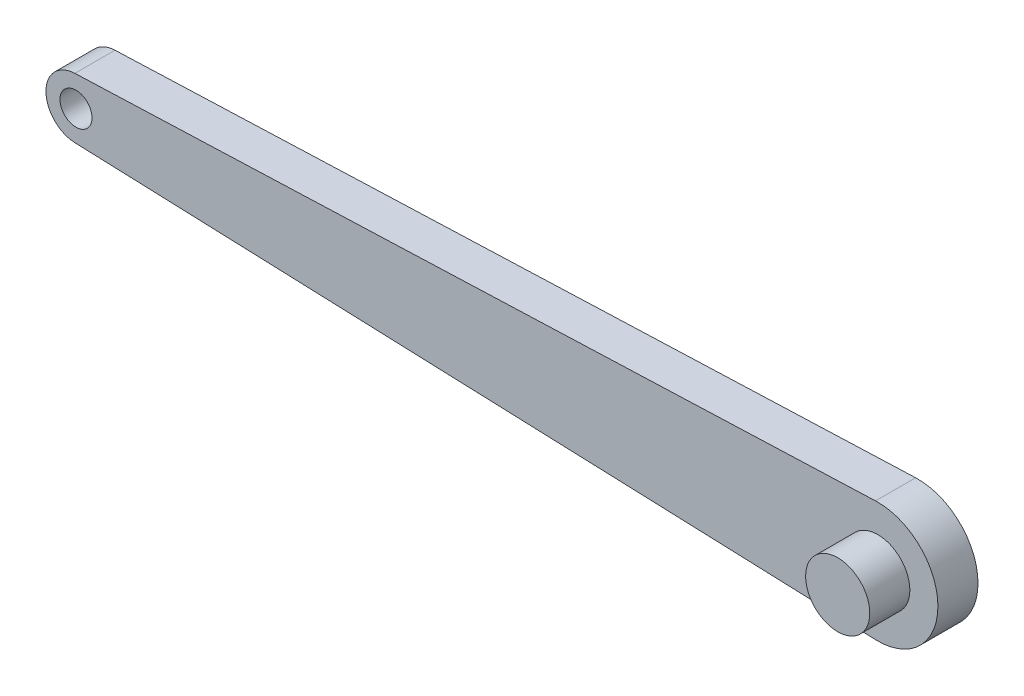
ISO-10303-21;
HEADER;
FILE_DESCRIPTION(('STEP AP214'),'2;1');
FILE_NAME('part.step','',(''),(''),'','','');
FILE_SCHEMA(('AUTOMOTIVE_DESIGN { 1 0 10303 214 1 1 1 1 }'));
ENDSEC;
DATA;
#1=APPLICATION_CONTEXT('core data for automotive mechanical design processes');
#2=APPLICATION_PROTOCOL_DEFINITION('international standard','automotive_design',2000,#1);
#3=PRODUCT_CONTEXT('',#1,'mechanical');
#4=PRODUCT('Part','Part','',(#3));
#5=PRODUCT_RELATED_PRODUCT_CATEGORY('part','',(#4));
#6=PRODUCT_DEFINITION_FORMATION('','',#4);
#7=PRODUCT_DEFINITION_CONTEXT('part definition',#1,'design');
#8=PRODUCT_DEFINITION('design','',#6,#7);
#9=PRODUCT_DEFINITION_SHAPE('','',#8);
#10=(LENGTH_UNIT() NAMED_UNIT(*) SI_UNIT(.MILLI.,.METRE.));
#11=(NAMED_UNIT(*) PLANE_ANGLE_UNIT() SI_UNIT($,.RADIAN.));
#12=(NAMED_UNIT(*) SI_UNIT($,.STERADIAN.) SOLID_ANGLE_UNIT());
#13=UNCERTAINTY_MEASURE_WITH_UNIT(LENGTH_MEASURE(1.E-05),#10,'distance_accuracy_value','');
#14=(GEOMETRIC_REPRESENTATION_CONTEXT(3) GLOBAL_UNCERTAINTY_ASSIGNED_CONTEXT((#13)) GLOBAL_UNIT_ASSIGNED_CONTEXT((#10,
#11,#12)) REPRESENTATION_CONTEXT('',''));
#15=CARTESIAN_POINT('',(0.,0.,0.));
#16=DIRECTION('',(0.,0.,1.));
#17=DIRECTION('',(1.,0.,0.));
#18=AXIS2_PLACEMENT_3D('',#15,#16,#17);
#19=CARTESIAN_POINT('',(0.,0.,-20.));
#20=DIRECTION('',(0.,0.,-1.));
#21=DIRECTION('',(1.,0.,0.));
#22=AXIS2_PLACEMENT_3D('',#19,#20,#21);
#23=PLANE('',#22);
#24=CARTESIAN_POINT('',(-200.,0.,-20.));
#25=DIRECTION('',(0.,0.,1.));
#26=DIRECTION('',(1.,0.,0.));
#27=AXIS2_PLACEMENT_3D('',#24,#25,#26);
#28=CIRCLE('',#27,3.99999999999999);
#29=CARTESIAN_POINT('',(-196.,0.,-20.));
#30=VERTEX_POINT('',#29);
#31=EDGE_CURVE('E152',#30,#30,#28,.T.);
#32=ORIENTED_EDGE('',*,*,#31,.F.);
#33=EDGE_LOOP('',(#32));
#34=FACE_BOUND('',#33,.T.);
#35=DIRECTION('',(0.999296627633657,0.0375000000000001,0.));
#36=VECTOR('',#35,1.);
#37=CARTESIAN_POINT('',(-0.562500000000002,14.9894494145049,-20.));
#38=LINE('',#37,#36);
#39=CARTESIAN_POINT('',(-200.28125,7.49472470725241,-20.));
#40=VERTEX_POINT('',#39);
#41=CARTESIAN_POINT('',(-0.562500000000002,14.9894494145049,-20.));
#42=VERTEX_POINT('',#41);
#43=EDGE_CURVE('E103',#40,#42,#38,.T.);
#44=ORIENTED_EDGE('',*,*,#43,.F.);
#45=CARTESIAN_POINT('',(-200.,0.,-20.));
#46=DIRECTION('',(0.,0.,1.));
#47=DIRECTION('',(1.,0.,0.));
#48=AXIS2_PLACEMENT_3D('',#45,#46,#47);
#49=CIRCLE('',#48,7.50000000000001);
#50=CARTESIAN_POINT('',(-200.28125,-7.49472470725246,-20.));
#51=VERTEX_POINT('',#50);
#52=EDGE_CURVE('E106',#40,#51,#49,.T.);
#53=ORIENTED_EDGE('',*,*,#52,.T.);
#54=DIRECTION('',(0.999296627633657,-0.0374999999999999,0.));
#55=VECTOR('',#54,1.);
#56=CARTESIAN_POINT('',(-0.562499999999998,-14.9894494145049,-20.));
#57=LINE('',#56,#55);
#58=CARTESIAN_POINT('',(-0.562499999999998,-14.9894494145049,-20.));
#59=VERTEX_POINT('',#58);
#60=EDGE_CURVE('E89',#51,#59,#57,.T.);
#61=ORIENTED_EDGE('',*,*,#60,.T.);
#62=CARTESIAN_POINT('',(0.,0.,-20.));
#63=DIRECTION('',(0.,0.,1.));
#64=DIRECTION('',(1.,0.,0.));
#65=AXIS2_PLACEMENT_3D('',#62,#63,#64);
#66=CIRCLE('',#65,15.);
#67=EDGE_CURVE('E98',#59,#42,#66,.T.);
#68=ORIENTED_EDGE('',*,*,#67,.T.);
#69=EDGE_LOOP('',(#44,#53,#61,#68));
#70=FACE_BOUND('',#69,.T.);
#71=CARTESIAN_POINT('',(0.,0.,-20.));
#72=DIRECTION('',(0.,0.,1.));
#73=DIRECTION('',(1.,0.,0.));
#74=AXIS2_PLACEMENT_3D('',#71,#72,#73);
#75=CIRCLE('',#74,8.);
#76=CARTESIAN_POINT('',(8.,0.,-20.));
#77=VERTEX_POINT('',#76);
#78=EDGE_CURVE('E11',#77,#77,#75,.F.);
#79=ORIENTED_EDGE('',*,*,#78,.T.);
#80=EDGE_LOOP('',(#79));
#81=FACE_BOUND('',#80,.T.);
#82=ADVANCED_FACE('F35',(#34,#70,#81),#23,.F.);
#83=CARTESIAN_POINT('',(-0.562500000000002,14.9894494145049,-30.));
#84=DIRECTION('',(-0.0375000000000001,0.999296627633657,0.));
#85=DIRECTION('',(-0.999296627633657,-0.0375000000000001,0.));
#86=AXIS2_PLACEMENT_3D('',#83,#84,#85);
#87=PLANE('',#86);
#88=ORIENTED_EDGE('',*,*,#43,.T.);
#89=DIRECTION('',(0.,0.,1.));
#90=VECTOR('',#89,1.);
#91=CARTESIAN_POINT('',(-0.562500000000002,14.9894494145049,-30.));
#92=LINE('',#91,#90);
#93=CARTESIAN_POINT('',(-0.562500000000002,14.9894494145049,-30.));
#94=VERTEX_POINT('',#93);
#95=EDGE_CURVE('E73',#94,#42,#92,.T.);
#96=ORIENTED_EDGE('',*,*,#95,.F.);
#97=DIRECTION('',(0.999296627633657,0.0375000000000001,0.));
#98=VECTOR('',#97,1.);
#99=CARTESIAN_POINT('',(-0.562500000000002,14.9894494145049,-30.));
#100=LINE('',#99,#98);
#101=CARTESIAN_POINT('',(-200.28125,7.49472470725241,-30.));
#102=VERTEX_POINT('',#101);
#103=EDGE_CURVE('E96',#102,#94,#100,.T.);
#104=ORIENTED_EDGE('',*,*,#103,.F.);
#105=DIRECTION('',(0.,0.,1.));
#106=VECTOR('',#105,1.);
#107=CARTESIAN_POINT('',(-200.28125,7.49472470725241,-30.));
#108=LINE('',#107,#106);
#109=EDGE_CURVE('E45',#102,#40,#108,.T.);
#110=ORIENTED_EDGE('',*,*,#109,.T.);
#111=EDGE_LOOP('',(#88,#96,#104,#110));
#112=FACE_BOUND('',#111,.T.);
#113=ADVANCED_FACE('F37',(#112),#87,.T.);
#114=CARTESIAN_POINT('',(-200.,0.,-30.));
#115=DIRECTION('',(0.,0.,1.));
#116=DIRECTION('',(-1.,0.,0.));
#117=AXIS2_PLACEMENT_3D('',#114,#115,#116);
#118=CYLINDRICAL_SURFACE('',#117,7.50000000000001);
#119=ORIENTED_EDGE('',*,*,#52,.F.);
#120=ORIENTED_EDGE('',*,*,#109,.F.);
#121=CARTESIAN_POINT('',(-200.,0.,-30.));
#122=DIRECTION('',(0.,0.,1.));
#123=DIRECTION('',(1.,0.,0.));
#124=AXIS2_PLACEMENT_3D('',#121,#122,#123);
#125=CIRCLE('',#124,7.50000000000001);
#126=CARTESIAN_POINT('',(-200.28125,-7.49472470725246,-30.));
#127=VERTEX_POINT('',#126);
#128=EDGE_CURVE('E80',#102,#127,#125,.T.);
#129=ORIENTED_EDGE('',*,*,#128,.T.);
#130=DIRECTION('',(0.,0.,1.));
#131=VECTOR('',#130,1.);
#132=CARTESIAN_POINT('',(-200.28125,-7.49472470725246,-30.));
#133=LINE('',#132,#131);
#134=EDGE_CURVE('E86',#127,#51,#133,.T.);
#135=ORIENTED_EDGE('',*,*,#134,.T.);
#136=EDGE_LOOP('',(#119,#120,#129,#135));
#137=FACE_BOUND('',#136,.T.);
#138=ADVANCED_FACE('F94',(#137),#118,.T.);
#139=CARTESIAN_POINT('',(-0.562499999999998,-14.9894494145049,-30.));
#140=DIRECTION('',(0.0374999999999998,0.999296627633657,0.));
#141=DIRECTION('',(-0.999296627633657,0.0374999999999999,0.));
#142=AXIS2_PLACEMENT_3D('',#139,#140,#141);
#143=PLANE('',#142);
#144=ORIENTED_EDGE('',*,*,#60,.F.);
#145=ORIENTED_EDGE('',*,*,#134,.F.);
#146=DIRECTION('',(0.999296627633657,-0.0374999999999999,0.));
#147=VECTOR('',#146,1.);
#148=CARTESIAN_POINT('',(-0.562499999999998,-14.9894494145049,-30.));
#149=LINE('',#148,#147);
#150=CARTESIAN_POINT('',(-0.562499999999998,-14.9894494145049,-30.));
#151=VERTEX_POINT('',#150);
#152=EDGE_CURVE('E82',#127,#151,#149,.T.);
#153=ORIENTED_EDGE('',*,*,#152,.T.);
#154=DIRECTION('',(0.,0.,1.));
#155=VECTOR('',#154,1.);
#156=CARTESIAN_POINT('',(-0.562499999999998,-14.9894494145049,-30.));
#157=LINE('',#156,#155);
#158=EDGE_CURVE('E69',#151,#59,#157,.T.);
#159=ORIENTED_EDGE('',*,*,#158,.T.);
#160=EDGE_LOOP('',(#144,#145,#153,#159));
#161=FACE_BOUND('',#160,.T.);
#162=ADVANCED_FACE('F87',(#161),#143,.F.);
#163=CARTESIAN_POINT('',(0.,0.,-30.));
#164=DIRECTION('',(0.,0.,1.));
#165=DIRECTION('',(-1.,0.,0.));
#166=AXIS2_PLACEMENT_3D('',#163,#164,#165);
#167=CYLINDRICAL_SURFACE('',#166,15.);
#168=ORIENTED_EDGE('',*,*,#67,.F.);
#169=ORIENTED_EDGE('',*,*,#158,.F.);
#170=CARTESIAN_POINT('',(0.,0.,-30.));
#171=DIRECTION('',(0.,0.,1.));
#172=DIRECTION('',(1.,0.,0.));
#173=AXIS2_PLACEMENT_3D('',#170,#171,#172);
#174=CIRCLE('',#173,15.);
#175=EDGE_CURVE('E53',#151,#94,#174,.T.);
#176=ORIENTED_EDGE('',*,*,#175,.T.);
#177=ORIENTED_EDGE('',*,*,#95,.T.);
#178=EDGE_LOOP('',(#168,#169,#176,#177));
#179=FACE_BOUND('',#178,.T.);
#180=ADVANCED_FACE('F117',(#179),#167,.T.);
#181=CARTESIAN_POINT('',(0.,0.,-30.));
#182=DIRECTION('',(0.,0.,-1.));
#183=DIRECTION('',(1.,0.,0.));
#184=AXIS2_PLACEMENT_3D('',#181,#182,#183);
#185=PLANE('',#184);
#186=CARTESIAN_POINT('',(-200.,0.,-30.));
#187=DIRECTION('',(0.,0.,1.));
#188=DIRECTION('',(1.,0.,0.));
#189=AXIS2_PLACEMENT_3D('',#186,#187,#188);
#190=CIRCLE('',#189,3.99999999999999);
#191=CARTESIAN_POINT('',(-196.,0.,-30.));
#192=VERTEX_POINT('',#191);
#193=EDGE_CURVE('E39',#192,#192,#190,.T.);
#194=ORIENTED_EDGE('',*,*,#193,.T.);
#195=EDGE_LOOP('',(#194));
#196=FACE_BOUND('',#195,.T.);
#197=ORIENTED_EDGE('',*,*,#103,.T.);
#198=ORIENTED_EDGE('',*,*,#175,.F.);
#199=ORIENTED_EDGE('',*,*,#152,.F.);
#200=ORIENTED_EDGE('',*,*,#128,.F.);
#201=EDGE_LOOP('',(#197,#198,#199,#200));
#202=FACE_BOUND('',#201,.T.);
#203=ADVANCED_FACE('F84',(#196,#202),#185,.T.);
#204=CARTESIAN_POINT('',(0.,0.,-10.));
#205=DIRECTION('',(0.,0.,-1.));
#206=DIRECTION('',(1.,0.,0.));
#207=AXIS2_PLACEMENT_3D('',#204,#205,#206);
#208=CYLINDRICAL_SURFACE('',#207,8.);
#209=CARTESIAN_POINT('',(0.,0.,-10.));
#210=DIRECTION('',(0.,0.,-1.));
#211=DIRECTION('',(-1.,0.,0.));
#212=AXIS2_PLACEMENT_3D('',#209,#210,#211);
#213=CIRCLE('',#212,8.);
#214=CARTESIAN_POINT('',(-8.,0.,-10.));
#215=VERTEX_POINT('',#214);
#216=EDGE_CURVE('E107',#215,#215,#213,.T.);
#217=ORIENTED_EDGE('',*,*,#216,.T.);
#218=EDGE_LOOP('',(#217));
#219=FACE_BOUND('',#218,.T.);
#220=ORIENTED_EDGE('',*,*,#78,.F.);
#221=EDGE_LOOP('',(#220));
#222=FACE_BOUND('',#221,.T.);
#223=ADVANCED_FACE('F124',(#219,#222),#208,.T.);
#224=CARTESIAN_POINT('',(0.,0.,-10.));
#225=DIRECTION('',(0.,0.,1.));
#226=DIRECTION('',(-1.,0.,0.));
#227=AXIS2_PLACEMENT_3D('',#224,#225,#226);
#228=PLANE('',#227);
#229=ORIENTED_EDGE('',*,*,#216,.F.);
#230=EDGE_LOOP('',(#229));
#231=FACE_BOUND('',#230,.T.);
#232=ADVANCED_FACE('F138',(#231),#228,.T.);
#233=CARTESIAN_POINT('',(-200.,0.,-80.));
#234=DIRECTION('',(0.,0.,1.));
#235=DIRECTION('',(-1.,0.,0.));
#236=AXIS2_PLACEMENT_3D('',#233,#234,#235);
#237=CYLINDRICAL_SURFACE('',#236,3.99999999999999);
#238=ORIENTED_EDGE('',*,*,#193,.F.);
#239=EDGE_LOOP('',(#238));
#240=FACE_BOUND('',#239,.T.);
#241=ORIENTED_EDGE('',*,*,#31,.T.);
#242=EDGE_LOOP('',(#241));
#243=FACE_BOUND('',#242,.T.);
#244=ADVANCED_FACE('F142',(#240,#243),#237,.F.);
#245=CLOSED_SHELL('',(#82,#113,#138,#162,#180,#203,#223,#232,#244));
#246=MANIFOLD_SOLID_BREP('B2',#245);
#247=ADVANCED_BREP_SHAPE_REPRESENTATION('',(#18,#246),#14);
#248=SHAPE_DEFINITION_REPRESENTATION(#9,#247);
ENDSEC;
END-ISO-10303-21;
